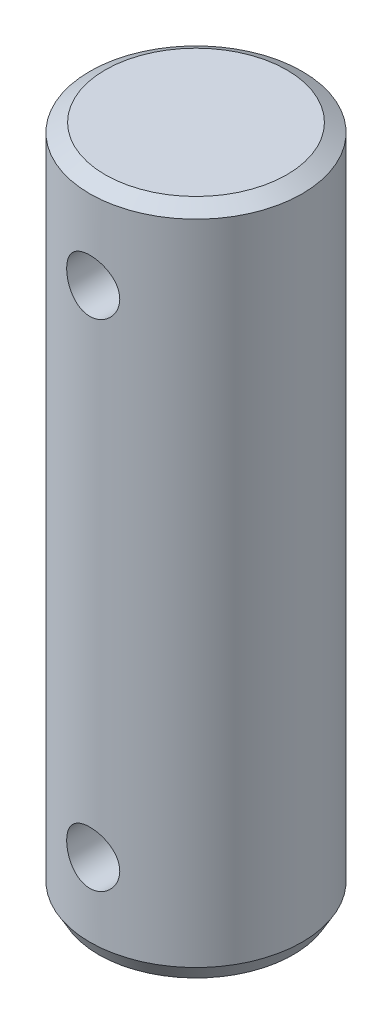
ISO-10303-21;
HEADER;
FILE_DESCRIPTION(('STEP AP214'),'2;1');
FILE_NAME('part.step','',(''),(''),'','','');
FILE_SCHEMA(('AUTOMOTIVE_DESIGN { 1 0 10303 214 1 1 1 1 }'));
ENDSEC;
DATA;
#1=APPLICATION_CONTEXT('core data for automotive mechanical design processes');
#2=APPLICATION_PROTOCOL_DEFINITION('international standard','automotive_design',2000,#1);
#3=PRODUCT_CONTEXT('',#1,'mechanical');
#4=PRODUCT('Part','Part','',(#3));
#5=PRODUCT_RELATED_PRODUCT_CATEGORY('part','',(#4));
#6=PRODUCT_DEFINITION_FORMATION('','',#4);
#7=PRODUCT_DEFINITION_CONTEXT('part definition',#1,'design');
#8=PRODUCT_DEFINITION('design','',#6,#7);
#9=PRODUCT_DEFINITION_SHAPE('','',#8);
#10=(LENGTH_UNIT() NAMED_UNIT(*) SI_UNIT(.MILLI.,.METRE.));
#11=(NAMED_UNIT(*) PLANE_ANGLE_UNIT() SI_UNIT($,.RADIAN.));
#12=(NAMED_UNIT(*) SI_UNIT($,.STERADIAN.) SOLID_ANGLE_UNIT());
#13=UNCERTAINTY_MEASURE_WITH_UNIT(LENGTH_MEASURE(1.E-05),#10,'distance_accuracy_value','');
#14=(GEOMETRIC_REPRESENTATION_CONTEXT(3) GLOBAL_UNCERTAINTY_ASSIGNED_CONTEXT((#13)) GLOBAL_UNIT_ASSIGNED_CONTEXT((#10,
#11,#12)) REPRESENTATION_CONTEXT('',''));
#15=CARTESIAN_POINT('',(0.,0.,0.));
#16=DIRECTION('',(0.,0.,1.));
#17=DIRECTION('',(1.,0.,0.));
#18=AXIS2_PLACEMENT_3D('',#15,#16,#17);
#19=CARTESIAN_POINT('',(0.,19.,0.));
#20=DIRECTION('',(0.,-1.,0.));
#21=DIRECTION('',(0.,0.,-1.));
#22=AXIS2_PLACEMENT_3D('',#19,#20,#21);
#23=CYLINDRICAL_SURFACE('',#22,6.);
#24=CARTESIAN_POINT('',(0.,15.5,-6.));
#25=CARTESIAN_POINT('',(-0.082876088669731,15.4999976742618,-5.99999859868013));
#26=CARTESIAN_POINT('',(-0.165778157830763,15.4931084492262,-5.99826578131828));
#27=CARTESIAN_POINT('',(-0.329206323770532,15.465774848693,-5.99152113829892));
#28=CARTESIAN_POINT('',(-0.409731046870739,15.4453227904621,-5.98650745419968));
#29=CARTESIAN_POINT('',(-0.566020872182577,15.3915607465379,-5.9737562633204));
#30=CARTESIAN_POINT('',(-0.641791563430002,15.3582662012847,-5.96602202842087));
#31=CARTESIAN_POINT('',(-0.786672131904426,15.2798186099552,-5.94865343807593));
#32=CARTESIAN_POINT('',(-0.855781784348759,15.2346651638811,-5.9390190185405));
#33=CARTESIAN_POINT('',(-0.986801927300919,15.1327992103458,-5.91867413591801));
#34=CARTESIAN_POINT('',(-1.04855569006107,15.0758884250408,-5.90794707148533));
#35=CARTESIAN_POINT('',(-1.1617489272033,14.9525477950911,-5.8867362011753));
#36=CARTESIAN_POINT('',(-1.21318723694913,14.8861168770535,-5.87625242288348));
#37=CARTESIAN_POINT('',(-1.30502654279903,14.7444047732626,-5.8565477569971));
#38=CARTESIAN_POINT('',(-1.34525221592536,14.6690067691896,-5.84734794470605));
#39=CARTESIAN_POINT('',(-1.41239690855053,14.5122515883416,-5.83149494812223));
#40=CARTESIAN_POINT('',(-1.43931805543933,14.4308953666742,-5.82484135672789));
#41=CARTESIAN_POINT('',(-1.47855483680429,14.2662565017975,-5.81500476717551));
#42=CARTESIAN_POINT('',(-1.49115226833334,14.1830451039502,-5.81175491075426));
#43=CARTESIAN_POINT('',(-1.50226177506785,14.015631430986,-5.80889362537741));
#44=CARTESIAN_POINT('',(-1.50077614181798,13.9314293193014,-5.80928160448644));
#45=CARTESIAN_POINT('',(-1.48398652463928,13.7665841922555,-5.81359205496618));
#46=CARTESIAN_POINT('',(-1.46901834019052,13.6859043785349,-5.81742863001879));
#47=CARTESIAN_POINT('',(-1.42622418690311,13.5282389490887,-5.82806709676484));
#48=CARTESIAN_POINT('',(-1.39839730206942,13.451253596971,-5.83486919970696));
#49=CARTESIAN_POINT('',(-1.33038947793715,13.3022619837479,-5.85075113904187));
#50=CARTESIAN_POINT('',(-1.29008666723291,13.2303138282104,-5.85985327469421));
#51=CARTESIAN_POINT('',(-1.19835627601495,13.0940812902432,-5.87929710846386));
#52=CARTESIAN_POINT('',(-1.14692674880884,13.0297982519327,-5.88963902334735));
#53=CARTESIAN_POINT('',(-1.03266342468122,12.9087963843056,-5.91075880539781));
#54=CARTESIAN_POINT('',(-0.969546258165859,12.8523455099386,-5.92154069477971));
#55=CARTESIAN_POINT('',(-0.834611917503699,12.7507787575361,-5.94205965578786));
#56=CARTESIAN_POINT('',(-0.762794477707943,12.7056632257364,-5.95179669549415));
#57=CARTESIAN_POINT('',(-0.612115888681392,12.6279494137756,-5.96917732094183));
#58=CARTESIAN_POINT('',(-0.533231393208624,12.5953946597456,-5.97681360127725));
#59=CARTESIAN_POINT('',(-0.370876008142884,12.5440826942904,-5.98907916991419));
#60=CARTESIAN_POINT('',(-0.287405999150485,12.5253228435819,-5.99370903339281));
#61=CARTESIAN_POINT('',(-0.120539970390027,12.5025424344412,-5.99935499271375));
#62=CARTESIAN_POINT('',(-0.0371967199882098,12.4981569739247,-6.00046053508279));
#63=CARTESIAN_POINT('',(0.129032874801508,12.5032490020555,-5.99918804814451));
#64=CARTESIAN_POINT('',(0.211919259644595,12.5127252427991,-5.99681033241847));
#65=CARTESIAN_POINT('',(0.373614268776491,12.5449709083914,-5.98889581127357));
#66=CARTESIAN_POINT('',(0.452465118968754,12.567541263477,-5.98340634185811));
#67=CARTESIAN_POINT('',(0.605257292452511,12.6251070840284,-5.96988706634134));
#68=CARTESIAN_POINT('',(0.679198119032634,12.6601038043132,-5.96185700369892));
#69=CARTESIAN_POINT('',(0.821523134429847,12.7422361288747,-5.94393307926311));
#70=CARTESIAN_POINT('',(0.88978544183583,12.7895761123968,-5.93400867366932));
#71=CARTESIAN_POINT('',(1.01752661364325,12.894789908797,-5.91344509187419));
#72=CARTESIAN_POINT('',(1.07700395897301,12.9526655396169,-5.90280579251705));
#73=CARTESIAN_POINT('',(1.18699056807273,13.0790019608445,-5.88168956960771));
#74=CARTESIAN_POINT('',(1.23724386762203,13.1476877030024,-5.87122304187281));
#75=CARTESIAN_POINT('',(1.3255107590127,13.2927326344657,-5.85192878377239));
#76=CARTESIAN_POINT('',(1.36352489415794,13.3690914829598,-5.84310098067026));
#77=CARTESIAN_POINT('',(1.42595142060929,13.5269057224131,-5.82818094734665));
#78=CARTESIAN_POINT('',(1.45044439665406,13.608327628344,-5.82207255291906));
#79=CARTESIAN_POINT('',(1.48534565995378,13.7743096378891,-5.81326744090184));
#80=CARTESIAN_POINT('',(1.49575702747866,13.8588690510325,-5.81056997719936));
#81=CARTESIAN_POINT('',(1.50203859033399,14.0261210238552,-5.80894901203957));
#82=CARTESIAN_POINT('',(1.49831789778012,14.1087974351247,-5.80991932728264));
#83=CARTESIAN_POINT('',(1.47737727831287,14.272303888668,-5.81527909007843));
#84=CARTESIAN_POINT('',(1.46015762268677,14.3531339680136,-5.81966846891857));
#85=CARTESIAN_POINT('',(1.41293131944279,14.5102084590654,-5.83131260682723));
#86=CARTESIAN_POINT('',(1.38300140468038,14.5864773052402,-5.8385501523631));
#87=CARTESIAN_POINT('',(1.31126491360507,14.7329653827137,-5.85507755724829));
#88=CARTESIAN_POINT('',(1.26945669003419,14.8031837731869,-5.86436770120773));
#89=CARTESIAN_POINT('',(1.17386774863714,14.937554629002,-5.88425634263512));
#90=CARTESIAN_POINT('',(1.11980316291226,15.001501073424,-5.89488264831757));
#91=CARTESIAN_POINT('',(1.00178937118974,15.1195470447954,-5.91608027246286));
#92=CARTESIAN_POINT('',(0.937837821261146,15.173644230113,-5.9266515772706));
#93=CARTESIAN_POINT('',(0.80046758670259,15.2714113085646,-5.94677655647663));
#94=CARTESIAN_POINT('',(0.726898422316386,15.3148746136716,-5.95630833365868));
#95=CARTESIAN_POINT('',(0.573266059510476,15.3887474629405,-5.97304924975118));
#96=CARTESIAN_POINT('',(0.49320756343674,15.4191663606485,-5.98026005199781));
#97=CARTESIAN_POINT('',(0.344410253243473,15.4615718303297,-5.99048059565542));
#98=CARTESIAN_POINT('',(0.27638017090807,15.4759512430534,-5.99402585052691));
#99=CARTESIAN_POINT('',(0.138906071536284,15.4951659436219,-5.99878605231948));
#100=CARTESIAN_POINT('',(0.0694621612426168,15.5000019493053,-6.00000117450894));
#101=CARTESIAN_POINT('',(0.,15.5,-6.));
#102=B_SPLINE_CURVE_WITH_KNOTS('',3,(#24,#25,#26,#27,#28,#29,#30,#31,#32,#33,#34,#35,#36,#37,
#38,#39,#40,#41,#42,#43,#44,#45,#46,#47,#48,#49,#50,#51,#52,#53,#54,#55,#56,#57,#58,#59,#60,#61,
#62,#63,#64,#65,#66,#67,#68,#69,#70,#71,#72,#73,#74,#75,#76,#77,#78,#79,#80,#81,#82,#83,#84,#85,
#86,#87,#88,#89,#90,#91,#92,#93,#94,#95,#96,#97,#98,#99,#100,#101),.UNSPECIFIED.,.T.,.F.,(4,2,2,
2,2,2,2,2,2,2,2,2,2,2,2,2,2,2,2,2,2,2,2,2,2,2,2,2,2,2,2,2,2,2,2,2,2,2,4),(0.,0.24837371247189,
0.496888237763899,0.745104902286105,0.993329940169327,1.24614435437139,1.49898729580062,
1.75558647545807,2.01214461169368,2.2635629509943,2.51494038112697,2.76022497007018,
3.00552703466038,3.25330527873879,3.50112690836163,3.75601500969019,4.01091089558247,
4.26668229009114,4.52240473688643,4.77158308949276,5.02073901112743,5.26620274514037,
5.5116912732229,5.76153587565352,6.01142363008019,6.26744509204476,6.52345518749508,
6.77792254614036,7.03233423252407,7.27943780398612,7.52653640956034,7.77216400559447,
8.01782568136901,8.2698957640991,8.52202569770417,8.77872185499588,9.0352336382135,
9.24342242942149,9.45159556043039),.UNSPECIFIED.);
#103=CARTESIAN_POINT('',(0.,15.5,-6.));
#104=VERTEX_POINT('',#103);
#105=EDGE_CURVE('E10',#104,#104,#102,.T.);
#106=ORIENTED_EDGE('',*,*,#105,.T.);
#107=EDGE_LOOP('',(#106));
#108=FACE_BOUND('',#107,.T.);
#109=CARTESIAN_POINT('',(1.5,14.,5.80947501931113));
#110=CARTESIAN_POINT('',(1.49999764715507,13.9171695494452,5.80947660051185));
#111=CARTESIAN_POINT('',(1.49311574729838,13.8343130607932,5.81126583608348));
#112=CARTESIAN_POINT('',(1.46581387527848,13.6709794530956,5.81821117195949));
#113=CARTESIAN_POINT('',(1.44538602404532,13.590503747319,5.82336923173088));
#114=CARTESIAN_POINT('',(1.39169471977917,13.4343178770878,5.8364323475758));
#115=CARTESIAN_POINT('',(1.35844783671268,13.3586017067686,5.84433385614245));
#116=CARTESIAN_POINT('',(1.28011268475684,13.213813488476,5.86198915217285));
#117=CARTESIAN_POINT('',(1.23502391313642,13.1447417227519,5.87174301827101));
#118=CARTESIAN_POINT('',(1.13322505638712,13.0136830128427,5.89224429813367));
#119=CARTESIAN_POINT('',(1.07630213262243,12.95186383979,5.90300758573818));
#120=CARTESIAN_POINT('',(0.952909238460399,12.8385431633838,5.92417725309178));
#121=CARTESIAN_POINT('',(0.886438376508185,12.7870426246269,5.93458359939834));
#122=CARTESIAN_POINT('',(0.744687120647374,12.6951347194212,5.95404249312349));
#123=CARTESIAN_POINT('',(0.669296745717073,12.6548921671031,5.96307412440355));
#124=CARTESIAN_POINT('',(0.512557910575658,12.5877142135081,5.97858487155591));
#125=CARTESIAN_POINT('',(0.431210331475165,12.5607768488507,5.98506436400607));
#126=CARTESIAN_POINT('',(0.266615255252498,12.5215112992528,5.99462855308908));
#127=CARTESIAN_POINT('',(0.183439631729386,12.5088982134041,5.99777936306589));
#128=CARTESIAN_POINT('',(0.0160972915576628,12.4977449724347,6.00056156464379));
#129=CARTESIAN_POINT('',(-0.0680692767228398,12.4992027366742,6.00019347658022));
#130=CARTESIAN_POINT('',(-0.233028370758579,12.5159449101501,5.99602856972121));
#131=CARTESIAN_POINT('',(-0.313854323401599,12.5309217950323,5.99230801404524));
#132=CARTESIAN_POINT('',(-0.471807371120528,12.5737827620291,5.98194501914912));
#133=CARTESIAN_POINT('',(-0.548934269055656,12.6016675312264,5.97530242439065));
#134=CARTESIAN_POINT('',(-0.698110055252709,12.6698015424122,5.95972505820537));
#135=CARTESIAN_POINT('',(-0.770106764649755,12.710160226797,5.95077011817032));
#136=CARTESIAN_POINT('',(-0.906413433510732,12.8020134074698,5.9315394228579));
#137=CARTESIAN_POINT('',(-0.970722052628257,12.8535098411364,5.92126343791494));
#138=CARTESIAN_POINT('',(-1.09166105262743,12.9678252451894,5.90018228261712));
#139=CARTESIAN_POINT('',(-1.1480365186128,13.0309129354087,5.88937031715551));
#140=CARTESIAN_POINT('',(-1.24946456394453,13.1657599841241,5.86869026110024));
#141=CARTESIAN_POINT('',(-1.29451661406902,13.2375197476946,5.85882221463582));
#142=CARTESIAN_POINT('',(-1.3721821935339,13.3881740204894,5.84112298098989));
#143=CARTESIAN_POINT('',(-1.40473435045574,13.4671014381879,5.83330190235432));
#144=CARTESIAN_POINT('',(-1.45602843095451,13.6295512808459,5.82071184083974));
#145=CARTESIAN_POINT('',(-1.47477330982936,13.7130727183899,5.81594220486131));
#146=CARTESIAN_POINT('',(-1.49749778319911,13.8799757009139,5.81013213623485));
#147=CARTESIAN_POINT('',(-1.50185428435178,13.9633026759978,5.80899653456189));
#148=CARTESIAN_POINT('',(-1.49671019430933,14.1294931619469,5.81032406088624));
#149=CARTESIAN_POINT('',(-1.48721087870928,14.2123567147707,5.8127868576076));
#150=CARTESIAN_POINT('',(-1.4549552783626,14.3738685589728,5.82094249172736));
#151=CARTESIAN_POINT('',(-1.43241844096905,14.4525636359425,5.82658182140625));
#152=CARTESIAN_POINT('',(-1.37497084900237,14.605058874711,5.84040430962577));
#153=CARTESIAN_POINT('',(-1.34005862862753,14.6788584554332,5.84858776949168));
#154=CARTESIAN_POINT('',(-1.25806240076193,14.8210647667204,5.86677682255958));
#155=CARTESIAN_POINT('',(-1.21075305230138,14.8893373040259,5.87681501163985));
#156=CARTESIAN_POINT('',(-1.10559043940168,15.0171130176808,5.8975024984303));
#157=CARTESIAN_POINT('',(-1.04773544220816,15.07661474999,5.90815189637082));
#158=CARTESIAN_POINT('',(-0.921394081477089,15.1866866255426,5.92918441818964));
#159=CARTESIAN_POINT('',(-0.85267792879739,15.2369960375293,5.93955421237102));
#160=CARTESIAN_POINT('',(-0.707554024042014,15.3253615201707,5.95858329968241));
#161=CARTESIAN_POINT('',(-0.631146673436387,15.3634182299649,5.96724268202376));
#162=CARTESIAN_POINT('',(-0.473337302596636,15.4258676207168,5.98182069442989));
#163=CARTESIAN_POINT('',(-0.391976071541822,15.4503585706274,5.98775898013446));
#164=CARTESIAN_POINT('',(-0.226124640478212,15.485276200765,5.99631176037473));
#165=CARTESIAN_POINT('',(-0.141635047561866,15.4957055952434,5.99892689636045));
#166=CARTESIAN_POINT('',(0.0256252896649882,15.5020513843633,6.00051254113217));
#167=CARTESIAN_POINT('',(0.108380740449048,15.4983525636431,5.99957968320012));
#168=CARTESIAN_POINT('',(0.272051244622108,15.4774282590585,5.99438844686135));
#169=CARTESIAN_POINT('',(0.352966352671329,15.4602031774803,5.99013016735643));
#170=CARTESIAN_POINT('',(0.510256553467223,15.4129216703436,5.97878149280944));
#171=CARTESIAN_POINT('',(0.586653741871527,15.3829348200281,5.97170646753999));
#172=CARTESIAN_POINT('',(0.733375579562202,15.311044131471,5.95546933370076));
#173=CARTESIAN_POINT('',(0.803699461897576,15.2691387909956,5.94630696206604));
#174=CARTESIAN_POINT('',(0.938102892635848,15.1734271490044,5.92660874521999));
#175=CARTESIAN_POINT('',(1.00199248245088,15.1193597856389,5.91604525418417));
#176=CARTESIAN_POINT('',(1.11992253040688,15.0013657220393,5.89485973579863));
#177=CARTESIAN_POINT('',(1.17396048760228,14.9374365258531,5.88423769428834));
#178=CARTESIAN_POINT('',(1.27164303971884,14.800097878698,5.86391213790822));
#179=CARTESIAN_POINT('',(1.31507492916982,14.7265338148811,5.85422945594827));
#180=CARTESIAN_POINT('',(1.3888903449235,14.5729167651159,5.83715933325924));
#181=CARTESIAN_POINT('',(1.41928336463958,14.4928685508399,5.82977022370054));
#182=CARTESIAN_POINT('',(1.46163379284816,14.3441344822599,5.81927863109675));
#183=CARTESIAN_POINT('',(1.47598975589307,14.2761602534242,5.8156299450082));
#184=CARTESIAN_POINT('',(1.4951734388599,14.1387966965001,5.81072757878358));
#185=CARTESIAN_POINT('',(1.50000197155828,14.0694074896324,5.80947369434945));
#186=CARTESIAN_POINT('',(1.5,14.,5.80947501931113));
#187=B_SPLINE_CURVE_WITH_KNOTS('',3,(#109,#110,#111,#112,#113,#114,#115,#116,#117,#118,#119,
#120,#121,#122,#123,#124,#125,#126,#127,#128,#129,#130,#131,#132,#133,#134,#135,#136,#137,#138,
#139,#140,#141,#142,#143,#144,#145,#146,#147,#148,#149,#150,#151,#152,#153,#154,#155,#156,#157,
#158,#159,#160,#161,#162,#163,#164,#165,#166,#167,#168,#169,#170,#171,#172,#173,#174,#175,#176,
#177,#178,#179,#180,#181,#182,#183,#184,#185,#186),.UNSPECIFIED.,.T.,.F.,(4,2,2,2,2,2,2,2,2,2,2,
2,2,2,2,2,2,2,2,2,2,2,2,2,2,2,2,2,2,2,2,2,2,2,2,2,2,2,4),(0.,0.24823646504168,0.496617444857199,
0.744678436299613,0.992749960532872,1.24574372515786,1.4987611288792,1.75530897838752,
2.01181895908255,2.26313250597208,2.51440889199612,2.76010957613368,3.00582334034872,
3.25375724552667,3.50173431281348,3.75642279943147,4.01112318719881,4.26705859205041,
4.52293920077728,4.7720614485703,5.02116076310281,5.26618443005524,5.5112371285285,
5.76109707515494,6.01099811331027,6.26715198579191,6.52329249431732,6.77755243684157,
7.03176329345423,7.27910067676474,7.52643070426188,7.77242925935826,8.01845883442843,
8.27038257949243,8.52237018939305,8.77905886370806,9.03556032819972,9.24358696306398,
9.45159585059713),.UNSPECIFIED.);
#188=CARTESIAN_POINT('',(1.5,14.,5.80947501931113));
#189=VERTEX_POINT('',#188);
#190=EDGE_CURVE('E53',#189,#189,#187,.T.);
#191=ORIENTED_EDGE('',*,*,#190,.T.);
#192=EDGE_LOOP('',(#191));
#193=FACE_BOUND('',#192,.T.);
#194=CARTESIAN_POINT('',(0.,-12.5,-6.));
#195=CARTESIAN_POINT('',(-0.0828760886697316,-12.5000023257382,-5.99999859868013));
#196=CARTESIAN_POINT('',(-0.165778157830764,-12.5068915507738,-5.99826578131828));
#197=CARTESIAN_POINT('',(-0.329206323770533,-12.534225151307,-5.99152113829892));
#198=CARTESIAN_POINT('',(-0.409731046870739,-12.5546772095378,-5.98650745419968));
#199=CARTESIAN_POINT('',(-0.566020872182577,-12.6084392534621,-5.9737562633204));
#200=CARTESIAN_POINT('',(-0.641791563430002,-12.6417337987153,-5.96602202842087));
#201=CARTESIAN_POINT('',(-0.786672131904426,-12.7201813900448,-5.94865343807593));
#202=CARTESIAN_POINT('',(-0.855781784348759,-12.7653348361189,-5.9390190185405));
#203=CARTESIAN_POINT('',(-0.986801927300919,-12.8672007896542,-5.91867413591801));
#204=CARTESIAN_POINT('',(-1.04855569006107,-12.9241115749592,-5.90794707148533));
#205=CARTESIAN_POINT('',(-1.1617489272033,-13.0474522049089,-5.8867362011753));
#206=CARTESIAN_POINT('',(-1.21318723694913,-13.1138831229465,-5.87625242288348));
#207=CARTESIAN_POINT('',(-1.30502654279903,-13.2555952267374,-5.8565477569971));
#208=CARTESIAN_POINT('',(-1.34525221592536,-13.3309932308104,-5.84734794470605));
#209=CARTESIAN_POINT('',(-1.41239690855053,-13.4877484116584,-5.83149494812223));
#210=CARTESIAN_POINT('',(-1.43931805543933,-13.5691046333258,-5.82484135672789));
#211=CARTESIAN_POINT('',(-1.47855483680429,-13.7337434982025,-5.81500476717551));
#212=CARTESIAN_POINT('',(-1.49115226833334,-13.8169548960498,-5.81175491075426));
#213=CARTESIAN_POINT('',(-1.50226177506785,-13.984368569014,-5.80889362537741));
#214=CARTESIAN_POINT('',(-1.50077614181798,-14.0685706806986,-5.80928160448644));
#215=CARTESIAN_POINT('',(-1.48398652463928,-14.2334158077445,-5.81359205496618));
#216=CARTESIAN_POINT('',(-1.46901834019052,-14.3140956214651,-5.81742863001879));
#217=CARTESIAN_POINT('',(-1.42622418690311,-14.4717610509113,-5.82806709676484));
#218=CARTESIAN_POINT('',(-1.39839730206942,-14.548746403029,-5.83486919970696));
#219=CARTESIAN_POINT('',(-1.33038947793715,-14.6977380162521,-5.85075113904187));
#220=CARTESIAN_POINT('',(-1.29008666723291,-14.7696861717895,-5.85985327469421));
#221=CARTESIAN_POINT('',(-1.19835627601495,-14.9059187097568,-5.87929710846386));
#222=CARTESIAN_POINT('',(-1.14692674880884,-14.9702017480673,-5.88963902334735));
#223=CARTESIAN_POINT('',(-1.03266342468122,-15.0912036156944,-5.91075880539781));
#224=CARTESIAN_POINT('',(-0.969546258165859,-15.1476544900613,-5.92154069477971));
#225=CARTESIAN_POINT('',(-0.834611917503699,-15.2492212424639,-5.94205965578786));
#226=CARTESIAN_POINT('',(-0.762794477707943,-15.2943367742636,-5.95179669549415));
#227=CARTESIAN_POINT('',(-0.612115888681392,-15.3720505862244,-5.96917732094183));
#228=CARTESIAN_POINT('',(-0.533231393208624,-15.4046053402544,-5.97681360127725));
#229=CARTESIAN_POINT('',(-0.370876008142883,-15.4559173057096,-5.98907916991419));
#230=CARTESIAN_POINT('',(-0.287405999150485,-15.4746771564181,-5.99370903339281));
#231=CARTESIAN_POINT('',(-0.120539970390027,-15.4974575655588,-5.99935499271375));
#232=CARTESIAN_POINT('',(-0.0371967199882098,-15.5018430260753,-6.00046053508279));
#233=CARTESIAN_POINT('',(0.129032874801508,-15.4967509979445,-5.99918804814451));
#234=CARTESIAN_POINT('',(0.211919259644595,-15.4872747572009,-5.99681033241847));
#235=CARTESIAN_POINT('',(0.373614268776491,-15.4550290916086,-5.98889581127357));
#236=CARTESIAN_POINT('',(0.452465118968754,-15.432458736523,-5.98340634185811));
#237=CARTESIAN_POINT('',(0.605257292452511,-15.3748929159716,-5.96988706634134));
#238=CARTESIAN_POINT('',(0.679198119032634,-15.3398961956868,-5.96185700369892));
#239=CARTESIAN_POINT('',(0.821523134429847,-15.2577638711253,-5.94393307926311));
#240=CARTESIAN_POINT('',(0.88978544183583,-15.2104238876032,-5.93400867366932));
#241=CARTESIAN_POINT('',(1.01752661364325,-15.105210091203,-5.91344509187419));
#242=CARTESIAN_POINT('',(1.07700395897301,-15.0473344603831,-5.90280579251705));
#243=CARTESIAN_POINT('',(1.18699056807273,-14.9209980391555,-5.88168956960771));
#244=CARTESIAN_POINT('',(1.23724386762203,-14.8523122969976,-5.87122304187281));
#245=CARTESIAN_POINT('',(1.3255107590127,-14.7072673655343,-5.85192878377239));
#246=CARTESIAN_POINT('',(1.36352489415794,-14.6309085170402,-5.84310098067026));
#247=CARTESIAN_POINT('',(1.42595142060929,-14.4730942775869,-5.82818094734665));
#248=CARTESIAN_POINT('',(1.45044439665406,-14.391672371656,-5.82207255291906));
#249=CARTESIAN_POINT('',(1.48534565995378,-14.2256903621109,-5.81326744090184));
#250=CARTESIAN_POINT('',(1.49575702747866,-14.1411309489675,-5.81056997719936));
#251=CARTESIAN_POINT('',(1.50203859033399,-13.9738789761448,-5.80894901203957));
#252=CARTESIAN_POINT('',(1.49831789778012,-13.8912025648753,-5.80991932728264));
#253=CARTESIAN_POINT('',(1.47737727831287,-13.727696111332,-5.81527909007843));
#254=CARTESIAN_POINT('',(1.46015762268677,-13.6468660319864,-5.81966846891857));
#255=CARTESIAN_POINT('',(1.41293131944279,-13.4897915409346,-5.83131260682723));
#256=CARTESIAN_POINT('',(1.38300140468038,-13.4135226947598,-5.8385501523631));
#257=CARTESIAN_POINT('',(1.31126491360507,-13.2670346172863,-5.85507755724829));
#258=CARTESIAN_POINT('',(1.26945669003419,-13.1968162268131,-5.86436770120773));
#259=CARTESIAN_POINT('',(1.17386774863714,-13.062445370998,-5.88425634263512));
#260=CARTESIAN_POINT('',(1.11980316291226,-12.998498926576,-5.89488264831757));
#261=CARTESIAN_POINT('',(1.00178937118974,-12.8804529552046,-5.91608027246286));
#262=CARTESIAN_POINT('',(0.937837821261147,-12.826355769887,-5.9266515772706));
#263=CARTESIAN_POINT('',(0.800467586702591,-12.7285886914354,-5.94677655647663));
#264=CARTESIAN_POINT('',(0.726898422316388,-12.6851253863284,-5.95630833365868));
#265=CARTESIAN_POINT('',(0.573266059510477,-12.6112525370595,-5.97304924975118));
#266=CARTESIAN_POINT('',(0.493207563436741,-12.5808336393515,-5.98026005199781));
#267=CARTESIAN_POINT('',(0.344410253243473,-12.5384281696703,-5.99048059565542));
#268=CARTESIAN_POINT('',(0.27638017090807,-12.5240487569466,-5.99402585052691));
#269=CARTESIAN_POINT('',(0.138906071536284,-12.5048340563781,-5.99878605231948));
#270=CARTESIAN_POINT('',(0.0694621612426169,-12.4999980506947,-6.00000117450894));
#271=CARTESIAN_POINT('',(0.,-12.5,-6.));
#272=B_SPLINE_CURVE_WITH_KNOTS('',3,(#194,#195,#196,#197,#198,#199,#200,#201,#202,#203,#204,
#205,#206,#207,#208,#209,#210,#211,#212,#213,#214,#215,#216,#217,#218,#219,#220,#221,#222,#223,
#224,#225,#226,#227,#228,#229,#230,#231,#232,#233,#234,#235,#236,#237,#238,#239,#240,#241,#242,
#243,#244,#245,#246,#247,#248,#249,#250,#251,#252,#253,#254,#255,#256,#257,#258,#259,#260,#261,
#262,#263,#264,#265,#266,#267,#268,#269,#270,#271),.UNSPECIFIED.,.T.,.F.,(4,2,2,2,2,2,2,2,2,2,2,
2,2,2,2,2,2,2,2,2,2,2,2,2,2,2,2,2,2,2,2,2,2,2,2,2,2,2,4),(0.,0.24837371247189,0.496888237763898,
0.745104902286104,0.993329940169326,1.24614435437139,1.49898729580062,1.75558647545807,
2.01214461169368,2.2635629509943,2.51494038112697,2.76022497007018,3.00552703466038,
3.25330527873879,3.50112690836162,3.75601500969019,4.01091089558247,4.26668229009114,
4.52240473688642,4.77158308949276,5.02073901112742,5.26620274514037,5.5116912732229,
5.76153587565352,6.01142363008019,6.26744509204475,6.52345518749508,6.77792254614036,
7.03233423252407,7.27943780398612,7.52653640956034,7.77216400559447,8.01782568136901,
8.26989576409909,8.52202569770417,8.77872185499587,9.03523363821349,9.24342242942148,
9.45159556043039),.UNSPECIFIED.);
#273=CARTESIAN_POINT('',(0.,-12.5,-6.));
#274=VERTEX_POINT('',#273);
#275=EDGE_CURVE('E58',#274,#274,#272,.T.);
#276=ORIENTED_EDGE('',*,*,#275,.T.);
#277=EDGE_LOOP('',(#276));
#278=FACE_BOUND('',#277,.T.);
#279=CARTESIAN_POINT('',(1.5,-14.,5.80947501931113));
#280=CARTESIAN_POINT('',(1.49999764715507,-14.0828304505548,5.80947660051185));
#281=CARTESIAN_POINT('',(1.49311574729838,-14.1656869392068,5.81126583608348));
#282=CARTESIAN_POINT('',(1.46581387527848,-14.3290205469044,5.81821117195949));
#283=CARTESIAN_POINT('',(1.44538602404532,-14.409496252681,5.82336923173088));
#284=CARTESIAN_POINT('',(1.39169471977917,-14.5656821229122,5.8364323475758));
#285=CARTESIAN_POINT('',(1.35844783671268,-14.6413982932314,5.84433385614245));
#286=CARTESIAN_POINT('',(1.28011268475684,-14.786186511524,5.86198915217285));
#287=CARTESIAN_POINT('',(1.23502391313642,-14.8552582772481,5.87174301827101));
#288=CARTESIAN_POINT('',(1.13322505638712,-14.9863169871573,5.89224429813367));
#289=CARTESIAN_POINT('',(1.07630213262243,-15.04813616021,5.90300758573818));
#290=CARTESIAN_POINT('',(0.952909238460399,-15.1614568366162,5.92417725309178));
#291=CARTESIAN_POINT('',(0.886438376508185,-15.212957375373,5.93458359939834));
#292=CARTESIAN_POINT('',(0.744687120647374,-15.3048652805788,5.95404249312349));
#293=CARTESIAN_POINT('',(0.669296745717073,-15.3451078328969,5.96307412440355));
#294=CARTESIAN_POINT('',(0.512557910575658,-15.4122857864918,5.97858487155591));
#295=CARTESIAN_POINT('',(0.431210331475165,-15.4392231511493,5.98506436400607));
#296=CARTESIAN_POINT('',(0.266615255252498,-15.4784887007471,5.99462855308908));
#297=CARTESIAN_POINT('',(0.183439631729386,-15.4911017865959,5.99777936306589));
#298=CARTESIAN_POINT('',(0.0160972915576628,-15.5022550275653,6.00056156464379));
#299=CARTESIAN_POINT('',(-0.0680692767228398,-15.5007972633258,6.00019347658022));
#300=CARTESIAN_POINT('',(-0.233028370758579,-15.4840550898499,5.99602856972121));
#301=CARTESIAN_POINT('',(-0.313854323401599,-15.4690782049677,5.99230801404524));
#302=CARTESIAN_POINT('',(-0.471807371120528,-15.4262172379709,5.98194501914912));
#303=CARTESIAN_POINT('',(-0.548934269055656,-15.3983324687736,5.97530242439065));
#304=CARTESIAN_POINT('',(-0.698110055252709,-15.3301984575878,5.95972505820537));
#305=CARTESIAN_POINT('',(-0.770106764649755,-15.289839773203,5.95077011817032));
#306=CARTESIAN_POINT('',(-0.906413433510732,-15.1979865925302,5.9315394228579));
#307=CARTESIAN_POINT('',(-0.970722052628257,-15.1464901588636,5.92126343791494));
#308=CARTESIAN_POINT('',(-1.09166105262743,-15.0321747548106,5.90018228261712));
#309=CARTESIAN_POINT('',(-1.1480365186128,-14.9690870645913,5.88937031715551));
#310=CARTESIAN_POINT('',(-1.24946456394453,-14.8342400158758,5.86869026110024));
#311=CARTESIAN_POINT('',(-1.29451661406902,-14.7624802523054,5.85882221463582));
#312=CARTESIAN_POINT('',(-1.3721821935339,-14.6118259795106,5.84112298098989));
#313=CARTESIAN_POINT('',(-1.40473435045574,-14.5328985618121,5.83330190235432));
#314=CARTESIAN_POINT('',(-1.45602843095451,-14.3704487191541,5.82071184083974));
#315=CARTESIAN_POINT('',(-1.47477330982936,-14.2869272816101,5.81594220486131));
#316=CARTESIAN_POINT('',(-1.49749778319911,-14.1200242990861,5.81013213623485));
#317=CARTESIAN_POINT('',(-1.50185428435178,-14.0366973240022,5.80899653456189));
#318=CARTESIAN_POINT('',(-1.49671019430933,-13.8705068380531,5.81032406088624));
#319=CARTESIAN_POINT('',(-1.48721087870928,-13.7876432852293,5.8127868576076));
#320=CARTESIAN_POINT('',(-1.4549552783626,-13.6261314410272,5.82094249172736));
#321=CARTESIAN_POINT('',(-1.43241844096905,-13.5474363640575,5.82658182140625));
#322=CARTESIAN_POINT('',(-1.37497084900237,-13.394941125289,5.84040430962577));
#323=CARTESIAN_POINT('',(-1.34005862862753,-13.3211415445668,5.84858776949168));
#324=CARTESIAN_POINT('',(-1.25806240076193,-13.1789352332796,5.86677682255958));
#325=CARTESIAN_POINT('',(-1.21075305230138,-13.1106626959741,5.87681501163985));
#326=CARTESIAN_POINT('',(-1.10559043940168,-12.9828869823192,5.8975024984303));
#327=CARTESIAN_POINT('',(-1.04773544220816,-12.92338525001,5.90815189637082));
#328=CARTESIAN_POINT('',(-0.921394081477089,-12.8133133744574,5.92918441818964));
#329=CARTESIAN_POINT('',(-0.85267792879739,-12.7630039624707,5.93955421237102));
#330=CARTESIAN_POINT('',(-0.707554024042014,-12.6746384798293,5.95858329968241));
#331=CARTESIAN_POINT('',(-0.631146673436387,-12.6365817700351,5.96724268202376));
#332=CARTESIAN_POINT('',(-0.473337302596636,-12.5741323792832,5.98182069442989));
#333=CARTESIAN_POINT('',(-0.391976071541822,-12.5496414293726,5.98775898013446));
#334=CARTESIAN_POINT('',(-0.226124640478213,-12.5147237992349,5.99631176037473));
#335=CARTESIAN_POINT('',(-0.141635047561867,-12.5042944047566,5.99892689636045));
#336=CARTESIAN_POINT('',(0.0256252896649882,-12.4979486156367,6.00051254113217));
#337=CARTESIAN_POINT('',(0.108380740449048,-12.5016474363569,5.99957968320012));
#338=CARTESIAN_POINT('',(0.272051244622108,-12.5225717409415,5.99438844686135));
#339=CARTESIAN_POINT('',(0.352966352671329,-12.5397968225196,5.99013016735643));
#340=CARTESIAN_POINT('',(0.510256553467223,-12.5870783296564,5.97878149280944));
#341=CARTESIAN_POINT('',(0.586653741871527,-12.6170651799719,5.97170646753999));
#342=CARTESIAN_POINT('',(0.733375579562202,-12.688955868529,5.95546933370076));
#343=CARTESIAN_POINT('',(0.803699461897576,-12.7308612090043,5.94630696206604));
#344=CARTESIAN_POINT('',(0.938102892635849,-12.8265728509956,5.92660874521999));
#345=CARTESIAN_POINT('',(1.00199248245088,-12.8806402143611,5.91604525418417));
#346=CARTESIAN_POINT('',(1.11992253040688,-12.9986342779607,5.89485973579863));
#347=CARTESIAN_POINT('',(1.17396048760228,-13.0625634741469,5.88423769428834));
#348=CARTESIAN_POINT('',(1.27164303971884,-13.199902121302,5.86391213790822));
#349=CARTESIAN_POINT('',(1.31507492916982,-13.2734661851189,5.85422945594827));
#350=CARTESIAN_POINT('',(1.3888903449235,-13.4270832348841,5.83715933325924));
#351=CARTESIAN_POINT('',(1.41928336463958,-13.5071314491601,5.82977022370054));
#352=CARTESIAN_POINT('',(1.46163379284816,-13.6558655177401,5.81927863109675));
#353=CARTESIAN_POINT('',(1.47598975589307,-13.7238397465758,5.8156299450082));
#354=CARTESIAN_POINT('',(1.4951734388599,-13.8612033034999,5.81072757878358));
#355=CARTESIAN_POINT('',(1.50000197155828,-13.9305925103676,5.80947369434945));
#356=CARTESIAN_POINT('',(1.5,-14.,5.80947501931113));
#357=B_SPLINE_CURVE_WITH_KNOTS('',3,(#279,#280,#281,#282,#283,#284,#285,#286,#287,#288,#289,
#290,#291,#292,#293,#294,#295,#296,#297,#298,#299,#300,#301,#302,#303,#304,#305,#306,#307,#308,
#309,#310,#311,#312,#313,#314,#315,#316,#317,#318,#319,#320,#321,#322,#323,#324,#325,#326,#327,
#328,#329,#330,#331,#332,#333,#334,#335,#336,#337,#338,#339,#340,#341,#342,#343,#344,#345,#346,
#347,#348,#349,#350,#351,#352,#353,#354,#355,#356),.UNSPECIFIED.,.T.,.F.,(4,2,2,2,2,2,2,2,2,2,2,
2,2,2,2,2,2,2,2,2,2,2,2,2,2,2,2,2,2,2,2,2,2,2,2,2,2,2,4),(0.,0.24823646504168,0.496617444857199,
0.744678436299613,0.992749960532872,1.24574372515786,1.4987611288792,1.75530897838752,
2.01181895908255,2.26313250597208,2.51440889199612,2.76010957613368,3.00582334034872,
3.25375724552667,3.50173431281348,3.75642279943147,4.01112318719881,4.26705859205041,
4.52293920077728,4.7720614485703,5.02116076310281,5.26618443005524,5.5112371285285,
5.76109707515494,6.01099811331027,6.26715198579191,6.52329249431732,6.77755243684157,
7.03176329345423,7.27910067676474,7.52643070426188,7.77242925935826,8.01845883442843,
8.27038257949243,8.52237018939305,8.77905886370806,9.03556032819972,9.24358696306398,
9.45159585059712),.UNSPECIFIED.);
#358=CARTESIAN_POINT('',(1.5,-14.,5.80947501931113));
#359=VERTEX_POINT('',#358);
#360=EDGE_CURVE('E63',#359,#359,#357,.T.);
#361=ORIENTED_EDGE('',*,*,#360,.T.);
#362=EDGE_LOOP('',(#361));
#363=FACE_BOUND('',#362,.T.);
#364=CARTESIAN_POINT('',(0.,-18.1339745962156,0.));
#365=DIRECTION('',(0.,1.,0.));
#366=DIRECTION('',(0.,0.,1.));
#367=AXIS2_PLACEMENT_3D('',#364,#365,#366);
#368=CIRCLE('',#367,6.);
#369=CARTESIAN_POINT('',(0.,-18.1339745962156,6.));
#370=VERTEX_POINT('',#369);
#371=EDGE_CURVE('E101',#370,#370,#368,.T.);
#372=ORIENTED_EDGE('',*,*,#371,.T.);
#373=EDGE_LOOP('',(#372));
#374=FACE_BOUND('',#373,.T.);
#375=CARTESIAN_POINT('',(0.,18.5,0.));
#376=DIRECTION('',(0.,1.,0.));
#377=DIRECTION('',(0.,0.,1.));
#378=AXIS2_PLACEMENT_3D('',#375,#376,#377);
#379=CIRCLE('',#378,6.);
#380=CARTESIAN_POINT('',(0.,18.5,6.));
#381=VERTEX_POINT('',#380);
#382=EDGE_CURVE('E105',#381,#381,#379,.F.);
#383=ORIENTED_EDGE('',*,*,#382,.T.);
#384=EDGE_LOOP('',(#383));
#385=FACE_BOUND('',#384,.T.);
#386=ADVANCED_FACE('F39',(#108,#193,#278,#363,#374,#385),#23,.T.);
#387=CARTESIAN_POINT('',(0.,19.,0.));
#388=DIRECTION('',(0.,1.,0.));
#389=DIRECTION('',(0.,0.,1.));
#390=AXIS2_PLACEMENT_3D('',#387,#388,#389);
#391=PLANE('',#390);
#392=CARTESIAN_POINT('',(0.,19.,0.));
#393=DIRECTION('',(0.,1.,0.));
#394=DIRECTION('',(0.,0.,1.));
#395=AXIS2_PLACEMENT_3D('',#392,#393,#394);
#396=CIRCLE('',#395,5.13397459621557);
#397=CARTESIAN_POINT('',(0.,19.,5.13397459621557));
#398=VERTEX_POINT('',#397);
#399=EDGE_CURVE('E93',#398,#398,#396,.T.);
#400=ORIENTED_EDGE('',*,*,#399,.T.);
#401=EDGE_LOOP('',(#400));
#402=FACE_BOUND('',#401,.T.);
#403=ADVANCED_FACE('F85',(#402),#391,.T.);
#404=CARTESIAN_POINT('',(0.,-19.,0.));
#405=DIRECTION('',(0.,1.,0.));
#406=DIRECTION('',(0.,0.,1.));
#407=AXIS2_PLACEMENT_3D('',#404,#405,#406);
#408=PLANE('',#407);
#409=CARTESIAN_POINT('',(0.,-19.,0.));
#410=DIRECTION('',(0.,1.,0.));
#411=DIRECTION('',(0.,0.,1.));
#412=AXIS2_PLACEMENT_3D('',#409,#410,#411);
#413=CIRCLE('',#412,5.49999999999999);
#414=CARTESIAN_POINT('',(0.,-19.,5.49999999999999));
#415=VERTEX_POINT('',#414);
#416=EDGE_CURVE('E97',#415,#415,#413,.F.);
#417=ORIENTED_EDGE('',*,*,#416,.T.);
#418=EDGE_LOOP('',(#417));
#419=FACE_BOUND('',#418,.T.);
#420=ADVANCED_FACE('F117',(#419),#408,.F.);
#421=CARTESIAN_POINT('',(0.,-18.1339745962156,0.));
#422=DIRECTION('',(0.,1.,0.));
#423=DIRECTION('',(0.,0.,1.));
#424=AXIS2_PLACEMENT_3D('',#421,#422,#423);
#425=CONICAL_SURFACE('',#424,6.,0.523598775598305);
#426=ORIENTED_EDGE('',*,*,#416,.F.);
#427=EDGE_LOOP('',(#426));
#428=FACE_BOUND('',#427,.T.);
#429=ORIENTED_EDGE('',*,*,#371,.F.);
#430=EDGE_LOOP('',(#429));
#431=FACE_BOUND('',#430,.T.);
#432=ADVANCED_FACE('F113',(#428,#431),#425,.T.);
#433=CARTESIAN_POINT('',(0.,19.,0.));
#434=DIRECTION('',(0.,-1.,0.));
#435=DIRECTION('',(0.,0.,-1.));
#436=AXIS2_PLACEMENT_3D('',#433,#434,#435);
#437=CONICAL_SURFACE('',#436,5.13397459621557,1.0471975511966);
#438=ORIENTED_EDGE('',*,*,#382,.F.);
#439=EDGE_LOOP('',(#438));
#440=FACE_BOUND('',#439,.T.);
#441=ORIENTED_EDGE('',*,*,#399,.F.);
#442=EDGE_LOOP('',(#441));
#443=FACE_BOUND('',#442,.T.);
#444=ADVANCED_FACE('F42',(#440,#443),#437,.T.);
#445=CARTESIAN_POINT('',(0.,-14.,-6.));
#446=DIRECTION('',(0.,0.,1.));
#447=DIRECTION('',(1.,0.,0.));
#448=AXIS2_PLACEMENT_3D('',#445,#446,#447);
#449=CYLINDRICAL_SURFACE('',#448,1.5);
#450=ORIENTED_EDGE('',*,*,#360,.F.);
#451=EDGE_LOOP('',(#450));
#452=FACE_BOUND('',#451,.T.);
#453=ORIENTED_EDGE('',*,*,#275,.F.);
#454=EDGE_LOOP('',(#453));
#455=FACE_BOUND('',#454,.T.);
#456=ADVANCED_FACE('F78',(#452,#455),#449,.F.);
#457=CARTESIAN_POINT('',(0.,14.,-6.));
#458=DIRECTION('',(0.,0.,1.));
#459=DIRECTION('',(1.,0.,0.));
#460=AXIS2_PLACEMENT_3D('',#457,#458,#459);
#461=CYLINDRICAL_SURFACE('',#460,1.5);
#462=ORIENTED_EDGE('',*,*,#190,.F.);
#463=EDGE_LOOP('',(#462));
#464=FACE_BOUND('',#463,.T.);
#465=ORIENTED_EDGE('',*,*,#105,.F.);
#466=EDGE_LOOP('',(#465));
#467=FACE_BOUND('',#466,.T.);
#468=ADVANCED_FACE('F75',(#464,#467),#461,.F.);
#469=CLOSED_SHELL('',(#386,#403,#420,#432,#444,#456,#468));
#470=MANIFOLD_SOLID_BREP('B2',#469);
#471=ADVANCED_BREP_SHAPE_REPRESENTATION('',(#18,#470),#14);
#472=SHAPE_DEFINITION_REPRESENTATION(#9,#471);
ENDSEC;
END-ISO-10303-21;
